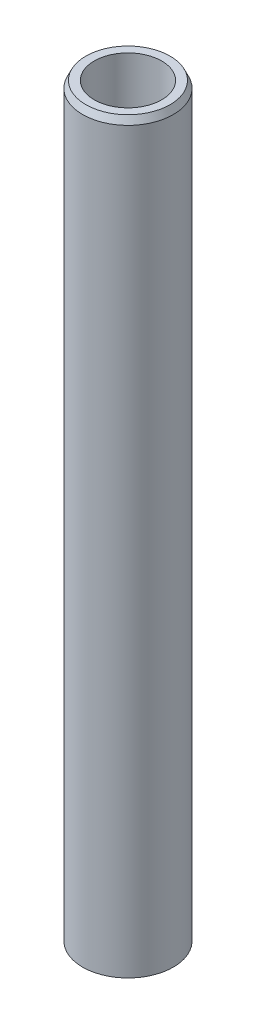
ISO-10303-21;
HEADER;
FILE_DESCRIPTION(('STEP AP214'),'2;1');
FILE_NAME('part.step','',(''),(''),'','','');
FILE_SCHEMA(('AUTOMOTIVE_DESIGN { 1 0 10303 214 1 1 1 1 }'));
ENDSEC;
DATA;
#1=APPLICATION_CONTEXT('core data for automotive mechanical design processes');
#2=APPLICATION_PROTOCOL_DEFINITION('international standard','automotive_design',2000,#1);
#3=PRODUCT_CONTEXT('',#1,'mechanical');
#4=PRODUCT('Part','Part','',(#3));
#5=PRODUCT_RELATED_PRODUCT_CATEGORY('part','',(#4));
#6=PRODUCT_DEFINITION_FORMATION('','',#4);
#7=PRODUCT_DEFINITION_CONTEXT('part definition',#1,'design');
#8=PRODUCT_DEFINITION('design','',#6,#7);
#9=PRODUCT_DEFINITION_SHAPE('','',#8);
#10=(LENGTH_UNIT() NAMED_UNIT(*) SI_UNIT(.MILLI.,.METRE.));
#11=(NAMED_UNIT(*) PLANE_ANGLE_UNIT() SI_UNIT($,.RADIAN.));
#12=(NAMED_UNIT(*) SI_UNIT($,.STERADIAN.) SOLID_ANGLE_UNIT());
#13=UNCERTAINTY_MEASURE_WITH_UNIT(LENGTH_MEASURE(1.E-05),#10,'distance_accuracy_value','');
#14=(GEOMETRIC_REPRESENTATION_CONTEXT(3) GLOBAL_UNCERTAINTY_ASSIGNED_CONTEXT((#13)) GLOBAL_UNIT_ASSIGNED_CONTEXT((#10,
#11,#12)) REPRESENTATION_CONTEXT('',''));
#15=CARTESIAN_POINT('',(0.,0.,0.));
#16=DIRECTION('',(0.,0.,1.));
#17=DIRECTION('',(1.,0.,0.));
#18=AXIS2_PLACEMENT_3D('',#15,#16,#17);
#19=CARTESIAN_POINT('',(0.,206.3304791012,0.));
#20=DIRECTION('',(0.,-1.,0.));
#21=DIRECTION('',(0.,0.,-1.));
#22=AXIS2_PLACEMENT_3D('',#19,#20,#21);
#23=CYLINDRICAL_SURFACE('',#22,12.5);
#24=CARTESIAN_POINT('',(0.,204.423442726765,0.));
#25=DIRECTION('',(0.,1.,0.));
#26=DIRECTION('',(0.,0.,1.));
#27=AXIS2_PLACEMENT_3D('',#24,#25,#26);
#28=CIRCLE('',#27,12.5);
#29=CARTESIAN_POINT('',(0.,204.423442726765,12.5));
#30=VERTEX_POINT('',#29);
#31=EDGE_CURVE('E50',#30,#30,#28,.F.);
#32=ORIENTED_EDGE('',*,*,#31,.T.);
#33=EDGE_LOOP('',(#32));
#34=FACE_BOUND('',#33,.T.);
#35=CARTESIAN_POINT('',(0.,0.893053331435412,0.));
#36=DIRECTION('',(0.,1.,0.));
#37=DIRECTION('',(0.,0.,1.));
#38=AXIS2_PLACEMENT_3D('',#35,#36,#37);
#39=CIRCLE('',#38,12.5);
#40=CARTESIAN_POINT('',(0.,0.893053331435412,12.5));
#41=VERTEX_POINT('',#40);
#42=EDGE_CURVE('E51',#41,#41,#39,.T.);
#43=ORIENTED_EDGE('',*,*,#42,.T.);
#44=EDGE_LOOP('',(#43));
#45=FACE_BOUND('',#44,.T.);
#46=ADVANCED_FACE('F39',(#34,#45),#23,.T.);
#47=CARTESIAN_POINT('',(0.,206.3304791012,0.));
#48=DIRECTION('',(0.,1.,0.));
#49=DIRECTION('',(0.,0.,1.));
#50=AXIS2_PLACEMENT_3D('',#47,#48,#49);
#51=PLANE('',#50);
#52=CARTESIAN_POINT('',(0.,206.3304791012,0.));
#53=DIRECTION('',(0.,1.,0.));
#54=DIRECTION('',(0.,0.,1.));
#55=AXIS2_PLACEMENT_3D('',#52,#53,#54);
#56=CIRCLE('',#55,11.6069466685645);
#57=CARTESIAN_POINT('',(0.,206.3304791012,11.6069466685645));
#58=VERTEX_POINT('',#57);
#59=EDGE_CURVE('E54',#58,#58,#56,.T.);
#60=ORIENTED_EDGE('',*,*,#59,.T.);
#61=EDGE_LOOP('',(#60));
#62=FACE_BOUND('',#61,.T.);
#63=CARTESIAN_POINT('',(0.,206.3304791012,0.));
#64=DIRECTION('',(0.,1.,0.));
#65=DIRECTION('',(0.,0.,1.));
#66=AXIS2_PLACEMENT_3D('',#63,#64,#65);
#67=CIRCLE('',#66,9.2903564666742);
#68=CARTESIAN_POINT('',(0.,206.3304791012,9.2903564666742));
#69=VERTEX_POINT('',#68);
#70=EDGE_CURVE('E58',#69,#69,#67,.T.);
#71=ORIENTED_EDGE('',*,*,#70,.F.);
#72=EDGE_LOOP('',(#71));
#73=FACE_BOUND('',#72,.T.);
#74=ADVANCED_FACE('F69',(#62,#73),#51,.T.);
#75=CARTESIAN_POINT('',(0.,0.,0.));
#76=DIRECTION('',(0.,1.,0.));
#77=DIRECTION('',(0.,0.,1.));
#78=AXIS2_PLACEMENT_3D('',#75,#76,#77);
#79=PLANE('',#78);
#80=CARTESIAN_POINT('',(0.,0.,0.));
#81=DIRECTION('',(0.,1.,0.));
#82=DIRECTION('',(0.,0.,1.));
#83=AXIS2_PLACEMENT_3D('',#80,#81,#82);
#84=CIRCLE('',#83,10.5929636255649);
#85=CARTESIAN_POINT('',(0.,0.,10.5929636255649));
#86=VERTEX_POINT('',#85);
#87=EDGE_CURVE('E10',#86,#86,#84,.F.);
#88=ORIENTED_EDGE('',*,*,#87,.T.);
#89=EDGE_LOOP('',(#88));
#90=FACE_BOUND('',#89,.T.);
#91=CARTESIAN_POINT('',(0.,0.,0.));
#92=DIRECTION('',(0.,1.,0.));
#93=DIRECTION('',(0.,0.,1.));
#94=AXIS2_PLACEMENT_3D('',#91,#92,#93);
#95=CIRCLE('',#94,9.2903564666742);
#96=CARTESIAN_POINT('',(0.,0.,9.2903564666742));
#97=VERTEX_POINT('',#96);
#98=EDGE_CURVE('E63',#97,#97,#95,.T.);
#99=ORIENTED_EDGE('',*,*,#98,.T.);
#100=EDGE_LOOP('',(#99));
#101=FACE_BOUND('',#100,.T.);
#102=ADVANCED_FACE('F75',(#90,#101),#79,.F.);
#103=CARTESIAN_POINT('',(0.,206.3304791012,0.));
#104=DIRECTION('',(0.,-1.,0.));
#105=DIRECTION('',(0.,0.,-1.));
#106=AXIS2_PLACEMENT_3D('',#103,#104,#105);
#107=CYLINDRICAL_SURFACE('',#106,9.2903564666742);
#108=ORIENTED_EDGE('',*,*,#70,.T.);
#109=EDGE_LOOP('',(#108));
#110=FACE_BOUND('',#109,.T.);
#111=ORIENTED_EDGE('',*,*,#98,.F.);
#112=EDGE_LOOP('',(#111));
#113=FACE_BOUND('',#112,.T.);
#114=ADVANCED_FACE('F70',(#110,#113),#107,.F.);
#115=CARTESIAN_POINT('',(0.,206.3304791012,0.));
#116=DIRECTION('',(0.,-1.,0.));
#117=DIRECTION('',(0.,0.,-1.));
#118=AXIS2_PLACEMENT_3D('',#115,#116,#117);
#119=CONICAL_SURFACE('',#118,11.6069466685645,0.437962485029898);
#120=ORIENTED_EDGE('',*,*,#31,.F.);
#121=EDGE_LOOP('',(#120));
#122=FACE_BOUND('',#121,.T.);
#123=ORIENTED_EDGE('',*,*,#59,.F.);
#124=EDGE_LOOP('',(#123));
#125=FACE_BOUND('',#124,.T.);
#126=ADVANCED_FACE('F81',(#122,#125),#119,.T.);
#127=CARTESIAN_POINT('',(0.,0.893053331435412,0.));
#128=DIRECTION('',(0.,1.,0.));
#129=DIRECTION('',(0.,0.,1.));
#130=AXIS2_PLACEMENT_3D('',#127,#128,#129);
#131=CONICAL_SURFACE('',#130,12.5,1.132833841765);
#132=ORIENTED_EDGE('',*,*,#87,.F.);
#133=EDGE_LOOP('',(#132));
#134=FACE_BOUND('',#133,.T.);
#135=ORIENTED_EDGE('',*,*,#42,.F.);
#136=EDGE_LOOP('',(#135));
#137=FACE_BOUND('',#136,.T.);
#138=ADVANCED_FACE('F45',(#134,#137),#131,.T.);
#139=CLOSED_SHELL('',(#46,#74,#102,#114,#126,#138));
#140=MANIFOLD_SOLID_BREP('B2',#139);
#141=ADVANCED_BREP_SHAPE_REPRESENTATION('',(#18,#140),#14);
#142=SHAPE_DEFINITION_REPRESENTATION(#9,#141);
ENDSEC;
END-ISO-10303-21;
